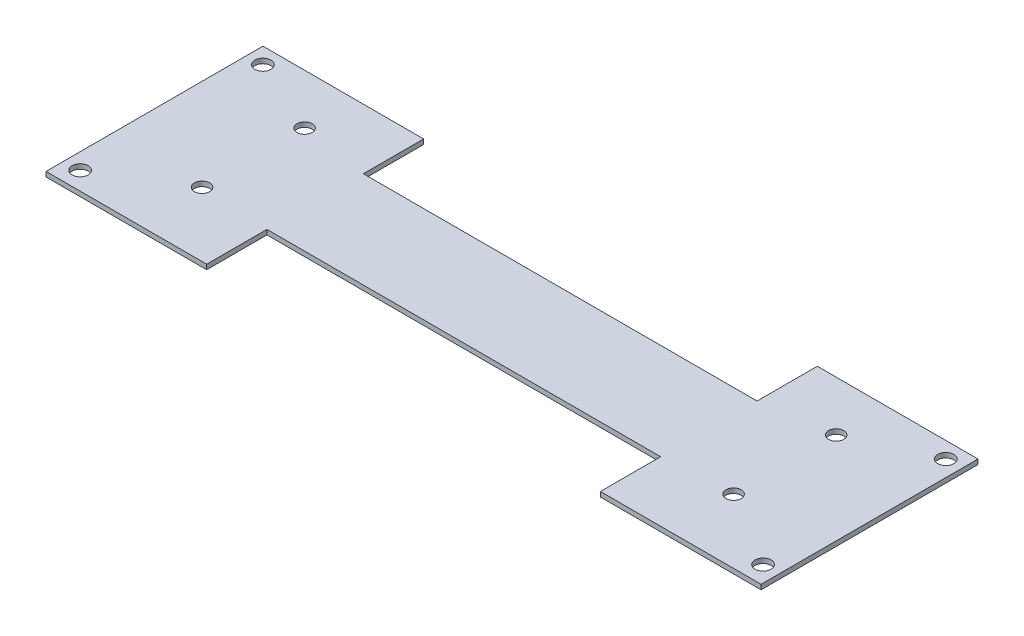
ISO-10303-21;
HEADER;
FILE_DESCRIPTION(('STEP AP214'),'2;1');
FILE_NAME('part.step','',(''),(''),'','','');
FILE_SCHEMA(('AUTOMOTIVE_DESIGN { 1 0 10303 214 1 1 1 1 }'));
ENDSEC;
DATA;
#1=APPLICATION_CONTEXT('core data for automotive mechanical design processes');
#2=APPLICATION_PROTOCOL_DEFINITION('international standard','automotive_design',2000,#1);
#3=PRODUCT_CONTEXT('',#1,'mechanical');
#4=PRODUCT('Part','Part','',(#3));
#5=PRODUCT_RELATED_PRODUCT_CATEGORY('part','',(#4));
#6=PRODUCT_DEFINITION_FORMATION('','',#4);
#7=PRODUCT_DEFINITION_CONTEXT('part definition',#1,'design');
#8=PRODUCT_DEFINITION('design','',#6,#7);
#9=PRODUCT_DEFINITION_SHAPE('','',#8);
#10=(LENGTH_UNIT() NAMED_UNIT(*) SI_UNIT(.MILLI.,.METRE.));
#11=(NAMED_UNIT(*) PLANE_ANGLE_UNIT() SI_UNIT($,.RADIAN.));
#12=(NAMED_UNIT(*) SI_UNIT($,.STERADIAN.) SOLID_ANGLE_UNIT());
#13=UNCERTAINTY_MEASURE_WITH_UNIT(LENGTH_MEASURE(1.E-05),#10,'distance_accuracy_value','');
#14=(GEOMETRIC_REPRESENTATION_CONTEXT(3) GLOBAL_UNCERTAINTY_ASSIGNED_CONTEXT((#13)) GLOBAL_UNIT_ASSIGNED_CONTEXT((#10,
#11,#12)) REPRESENTATION_CONTEXT('',''));
#15=CARTESIAN_POINT('',(0.,0.,0.));
#16=DIRECTION('',(0.,0.,1.));
#17=DIRECTION('',(1.,0.,0.));
#18=AXIS2_PLACEMENT_3D('',#15,#16,#17);
#19=CARTESIAN_POINT('',(-63.9018475988458,-1.2,-32.1837487972709));
#20=DIRECTION('',(0.,0.,-1.));
#21=DIRECTION('',(-1.,0.,0.));
#22=AXIS2_PLACEMENT_3D('',#19,#20,#21);
#23=PLANE('',#22);
#24=DIRECTION('',(0.,1.,0.));
#25=VECTOR('',#24,1.);
#26=CARTESIAN_POINT('',(74.0981524011542,-10.,-32.1837487972709));
#27=LINE('',#26,#25);
#28=CARTESIAN_POINT('',(74.0981524011542,-1.2,-32.1837487972709));
#29=VERTEX_POINT('',#28);
#30=CARTESIAN_POINT('',(74.0981524011542,0.,-32.1837487972709));
#31=VERTEX_POINT('',#30);
#32=EDGE_CURVE('E129',#29,#31,#27,.T.);
#33=ORIENTED_EDGE('',*,*,#32,.T.);
#34=DIRECTION('',(-1.,0.,0.));
#35=VECTOR('',#34,1.);
#36=CARTESIAN_POINT('',(-63.9018475988458,0.,-32.1837487972709));
#37=LINE('',#36,#35);
#38=CARTESIAN_POINT('',(114.098152401154,0.,-32.1837487972709));
#39=VERTEX_POINT('',#38);
#40=EDGE_CURVE('E143',#39,#31,#37,.T.);
#41=ORIENTED_EDGE('',*,*,#40,.F.);
#42=DIRECTION('',(0.,1.,0.));
#43=VECTOR('',#42,1.);
#44=CARTESIAN_POINT('',(114.098152401154,-1.2,-32.1837487972709));
#45=LINE('',#44,#43);
#46=CARTESIAN_POINT('',(114.098152401154,-1.2,-32.1837487972709));
#47=VERTEX_POINT('',#46);
#48=EDGE_CURVE('E43',#47,#39,#45,.T.);
#49=ORIENTED_EDGE('',*,*,#48,.F.);
#50=DIRECTION('',(-1.,0.,0.));
#51=VECTOR('',#50,1.);
#52=CARTESIAN_POINT('',(-63.9018475988458,-1.2,-32.1837487972709));
#53=LINE('',#52,#51);
#54=EDGE_CURVE('E145',#47,#29,#53,.T.);
#55=ORIENTED_EDGE('',*,*,#54,.T.);
#56=EDGE_LOOP('',(#33,#41,#49,#55));
#57=FACE_BOUND('',#56,.T.);
#58=ADVANCED_FACE('F34',(#57),#23,.T.);
#59=CARTESIAN_POINT('',(-63.9018475988458,-1.2,21.8162512027291));
#60=DIRECTION('',(0.,0.,1.));
#61=DIRECTION('',(1.,0.,0.));
#62=AXIS2_PLACEMENT_3D('',#59,#60,#61);
#63=PLANE('',#62);
#64=DIRECTION('',(0.,1.,0.));
#65=VECTOR('',#64,1.);
#66=CARTESIAN_POINT('',(74.0981524011542,-10.,21.8162512027291));
#67=LINE('',#66,#65);
#68=CARTESIAN_POINT('',(74.0981524011542,-1.2,21.8162512027291));
#69=VERTEX_POINT('',#68);
#70=CARTESIAN_POINT('',(74.0981524011542,0.,21.8162512027291));
#71=VERTEX_POINT('',#70);
#72=EDGE_CURVE('E186',#69,#71,#67,.T.);
#73=ORIENTED_EDGE('',*,*,#72,.F.);
#74=DIRECTION('',(1.,0.,0.));
#75=VECTOR('',#74,1.);
#76=CARTESIAN_POINT('',(-63.9018475988458,-1.2,21.8162512027291));
#77=LINE('',#76,#75);
#78=CARTESIAN_POINT('',(114.098152401154,-1.2,21.8162512027291));
#79=VERTEX_POINT('',#78);
#80=EDGE_CURVE('E157',#69,#79,#77,.T.);
#81=ORIENTED_EDGE('',*,*,#80,.T.);
#82=DIRECTION('',(0.,1.,0.));
#83=VECTOR('',#82,1.);
#84=CARTESIAN_POINT('',(114.098152401154,-1.2,21.8162512027291));
#85=LINE('',#84,#83);
#86=CARTESIAN_POINT('',(114.098152401154,0.,21.8162512027291));
#87=VERTEX_POINT('',#86);
#88=EDGE_CURVE('E162',#79,#87,#85,.T.);
#89=ORIENTED_EDGE('',*,*,#88,.T.);
#90=DIRECTION('',(1.,0.,0.));
#91=VECTOR('',#90,1.);
#92=CARTESIAN_POINT('',(-63.9018475988458,0.,21.8162512027291));
#93=LINE('',#92,#91);
#94=EDGE_CURVE('E178',#71,#87,#93,.T.);
#95=ORIENTED_EDGE('',*,*,#94,.F.);
#96=EDGE_LOOP('',(#73,#81,#89,#95));
#97=FACE_BOUND('',#96,.T.);
#98=ADVANCED_FACE('F185',(#97),#63,.T.);
#99=CARTESIAN_POINT('',(-63.9018475988458,-1.2,-32.1837487972709));
#100=DIRECTION('',(-1.,0.,0.));
#101=DIRECTION('',(0.,0.,1.));
#102=AXIS2_PLACEMENT_3D('',#99,#100,#101);
#103=PLANE('',#102);
#104=DIRECTION('',(0.,0.,1.));
#105=VECTOR('',#104,1.);
#106=CARTESIAN_POINT('',(-63.9018475988458,0.,-32.1837487972709));
#107=LINE('',#106,#105);
#108=CARTESIAN_POINT('',(-63.9018475988458,0.,-32.1837487972709));
#109=VERTEX_POINT('',#108);
#110=CARTESIAN_POINT('',(-63.9018475988458,0.,21.8162512027291));
#111=VERTEX_POINT('',#110);
#112=EDGE_CURVE('E176',#109,#111,#107,.T.);
#113=ORIENTED_EDGE('',*,*,#112,.F.);
#114=DIRECTION('',(0.,1.,0.));
#115=VECTOR('',#114,1.);
#116=CARTESIAN_POINT('',(-63.9018475988458,-1.2,-32.1837487972709));
#117=LINE('',#116,#115);
#118=CARTESIAN_POINT('',(-63.9018475988458,-1.2,-32.1837487972709));
#119=VERTEX_POINT('',#118);
#120=EDGE_CURVE('E11',#119,#109,#117,.T.);
#121=ORIENTED_EDGE('',*,*,#120,.F.);
#122=DIRECTION('',(0.,0.,1.));
#123=VECTOR('',#122,1.);
#124=CARTESIAN_POINT('',(-63.9018475988458,-1.2,-32.1837487972709));
#125=LINE('',#124,#123);
#126=CARTESIAN_POINT('',(-63.9018475988458,-1.2,21.8162512027291));
#127=VERTEX_POINT('',#126);
#128=EDGE_CURVE('E153',#119,#127,#125,.T.);
#129=ORIENTED_EDGE('',*,*,#128,.T.);
#130=DIRECTION('',(0.,1.,0.));
#131=VECTOR('',#130,1.);
#132=CARTESIAN_POINT('',(-63.9018475988458,-1.2,21.8162512027291));
#133=LINE('',#132,#131);
#134=EDGE_CURVE('E38',#127,#111,#133,.T.);
#135=ORIENTED_EDGE('',*,*,#134,.T.);
#136=EDGE_LOOP('',(#113,#121,#129,#135));
#137=FACE_BOUND('',#136,.T.);
#138=ADVANCED_FACE('F36',(#137),#103,.T.);
#139=DIRECTION('',(0.,1.,0.));
#140=VECTOR('',#139,1.);
#141=CARTESIAN_POINT('',(-23.9018475988458,-10.,-32.1837487972709));
#142=LINE('',#141,#140);
#143=CARTESIAN_POINT('',(-23.9018475988458,-1.2,-32.1837487972709));
#144=VERTEX_POINT('',#143);
#145=CARTESIAN_POINT('',(-23.9018475988458,0.,-32.1837487972709));
#146=VERTEX_POINT('',#145);
#147=EDGE_CURVE('E51',#144,#146,#142,.T.);
#148=ORIENTED_EDGE('',*,*,#147,.F.);
#149=EDGE_CURVE('E170',#144,#119,#53,.T.);
#150=ORIENTED_EDGE('',*,*,#149,.T.);
#151=ORIENTED_EDGE('',*,*,#120,.T.);
#152=EDGE_CURVE('E154',#146,#109,#37,.T.);
#153=ORIENTED_EDGE('',*,*,#152,.F.);
#154=EDGE_LOOP('',(#148,#150,#151,#153));
#155=FACE_BOUND('',#154,.T.);
#156=ADVANCED_FACE('F314',(#155),#23,.T.);
#157=CARTESIAN_POINT('',(114.098152401154,-1.2,-32.1837487972709));
#158=DIRECTION('',(1.,0.,0.));
#159=DIRECTION('',(0.,0.,-1.));
#160=AXIS2_PLACEMENT_3D('',#157,#158,#159);
#161=PLANE('',#160);
#162=DIRECTION('',(0.,0.,-1.));
#163=VECTOR('',#162,1.);
#164=CARTESIAN_POINT('',(114.098152401154,0.,-32.1837487972709));
#165=LINE('',#164,#163);
#166=EDGE_CURVE('E152',#87,#39,#165,.T.);
#167=ORIENTED_EDGE('',*,*,#166,.F.);
#168=ORIENTED_EDGE('',*,*,#88,.F.);
#169=DIRECTION('',(0.,0.,-1.));
#170=VECTOR('',#169,1.);
#171=CARTESIAN_POINT('',(114.098152401154,-1.2,-32.1837487972709));
#172=LINE('',#171,#170);
#173=EDGE_CURVE('E172',#79,#47,#172,.T.);
#174=ORIENTED_EDGE('',*,*,#173,.T.);
#175=ORIENTED_EDGE('',*,*,#48,.T.);
#176=EDGE_LOOP('',(#167,#168,#174,#175));
#177=FACE_BOUND('',#176,.T.);
#178=ADVANCED_FACE('F308',(#177),#161,.T.);
#179=DIRECTION('',(0.,1.,0.));
#180=VECTOR('',#179,1.);
#181=CARTESIAN_POINT('',(-23.9018475988458,-10.,21.8162512027291));
#182=LINE('',#181,#180);
#183=CARTESIAN_POINT('',(-23.9018475988458,-1.2,21.8162512027291));
#184=VERTEX_POINT('',#183);
#185=CARTESIAN_POINT('',(-23.9018475988458,0.,21.8162512027291));
#186=VERTEX_POINT('',#185);
#187=EDGE_CURVE('E189',#184,#186,#182,.T.);
#188=ORIENTED_EDGE('',*,*,#187,.T.);
#189=EDGE_CURVE('E180',#111,#186,#93,.T.);
#190=ORIENTED_EDGE('',*,*,#189,.F.);
#191=ORIENTED_EDGE('',*,*,#134,.F.);
#192=EDGE_CURVE('E200',#127,#184,#77,.T.);
#193=ORIENTED_EDGE('',*,*,#192,.T.);
#194=EDGE_LOOP('',(#188,#190,#191,#193));
#195=FACE_BOUND('',#194,.T.);
#196=ADVANCED_FACE('F302',(#195),#63,.T.);
#197=CARTESIAN_POINT('',(0.,-1.2,0.));
#198=DIRECTION('',(0.,1.,0.));
#199=DIRECTION('',(0.,0.,1.));
#200=AXIS2_PLACEMENT_3D('',#197,#198,#199);
#201=PLANE('',#200);
#202=CARTESIAN_POINT('',(-59.9018475988458,-1.2,-28.1837487972709));
#203=DIRECTION('',(0.,1.,0.));
#204=DIRECTION('',(0.,0.,1.));
#205=AXIS2_PLACEMENT_3D('',#202,#203,#204);
#206=CIRCLE('',#205,2.);
#207=CARTESIAN_POINT('',(-59.9018475988458,-1.2,-26.1837487972709));
#208=VERTEX_POINT('',#207);
#209=EDGE_CURVE('E273',#208,#208,#206,.T.);
#210=ORIENTED_EDGE('',*,*,#209,.T.);
#211=EDGE_LOOP('',(#210));
#212=FACE_BOUND('',#211,.T.);
#213=CARTESIAN_POINT('',(-59.9018475988458,-1.2,17.3162512027291));
#214=DIRECTION('',(0.,1.,0.));
#215=DIRECTION('',(0.,0.,1.));
#216=AXIS2_PLACEMENT_3D('',#213,#214,#215);
#217=CIRCLE('',#216,2.);
#218=CARTESIAN_POINT('',(-59.9018475988458,-1.2,19.3162512027291));
#219=VERTEX_POINT('',#218);
#220=EDGE_CURVE('E267',#219,#219,#217,.T.);
#221=ORIENTED_EDGE('',*,*,#220,.T.);
#222=EDGE_LOOP('',(#221));
#223=FACE_BOUND('',#222,.T.);
#224=CARTESIAN_POINT('',(110.098152401154,-1.2,-28.1837487972709));
#225=DIRECTION('',(0.,1.,0.));
#226=DIRECTION('',(0.,0.,1.));
#227=AXIS2_PLACEMENT_3D('',#224,#225,#226);
#228=CIRCLE('',#227,2.);
#229=CARTESIAN_POINT('',(110.098152401154,-1.2,-26.1837487972709));
#230=VERTEX_POINT('',#229);
#231=EDGE_CURVE('E261',#230,#230,#228,.T.);
#232=ORIENTED_EDGE('',*,*,#231,.T.);
#233=EDGE_LOOP('',(#232));
#234=FACE_BOUND('',#233,.T.);
#235=CARTESIAN_POINT('',(110.098152401154,-1.2,17.3162512027291));
#236=DIRECTION('',(0.,1.,0.));
#237=DIRECTION('',(0.,0.,1.));
#238=AXIS2_PLACEMENT_3D('',#235,#236,#237);
#239=CIRCLE('',#238,2.);
#240=CARTESIAN_POINT('',(110.098152401154,-1.2,19.3162512027291));
#241=VERTEX_POINT('',#240);
#242=EDGE_CURVE('E138',#241,#241,#239,.T.);
#243=ORIENTED_EDGE('',*,*,#242,.T.);
#244=EDGE_LOOP('',(#243));
#245=FACE_BOUND('',#244,.T.);
#246=DIRECTION('',(1.,0.,0.));
#247=VECTOR('',#246,1.);
#248=CARTESIAN_POINT('',(0.,-1.2,-17.1837487972709));
#249=LINE('',#248,#247);
#250=CARTESIAN_POINT('',(-23.9018475988458,-1.2,-17.1837487972709));
#251=VERTEX_POINT('',#250);
#252=CARTESIAN_POINT('',(74.0981524011542,-1.2,-17.1837487972709));
#253=VERTEX_POINT('',#252);
#254=EDGE_CURVE('E245',#251,#253,#249,.T.);
#255=ORIENTED_EDGE('',*,*,#254,.T.);
#256=DIRECTION('',(0.,0.,-1.));
#257=VECTOR('',#256,1.);
#258=CARTESIAN_POINT('',(74.0981524011542,-1.2,0.));
#259=LINE('',#258,#257);
#260=EDGE_CURVE('E243',#253,#29,#259,.T.);
#261=ORIENTED_EDGE('',*,*,#260,.T.);
#262=ORIENTED_EDGE('',*,*,#54,.F.);
#263=ORIENTED_EDGE('',*,*,#173,.F.);
#264=ORIENTED_EDGE('',*,*,#80,.F.);
#265=DIRECTION('',(0.,0.,-1.));
#266=VECTOR('',#265,1.);
#267=CARTESIAN_POINT('',(74.0981524011542,-1.2,0.));
#268=LINE('',#267,#266);
#269=CARTESIAN_POINT('',(74.0981524011542,-1.2,6.81625120272913));
#270=VERTEX_POINT('',#269);
#271=EDGE_CURVE('E198',#69,#270,#268,.T.);
#272=ORIENTED_EDGE('',*,*,#271,.T.);
#273=DIRECTION('',(-1.,0.,0.));
#274=VECTOR('',#273,1.);
#275=CARTESIAN_POINT('',(0.,-1.2,6.81625120272913));
#276=LINE('',#275,#274);
#277=CARTESIAN_POINT('',(-23.9018475988458,-1.2,6.81625120272913));
#278=VERTEX_POINT('',#277);
#279=EDGE_CURVE('E188',#270,#278,#276,.T.);
#280=ORIENTED_EDGE('',*,*,#279,.T.);
#281=DIRECTION('',(0.,0.,1.));
#282=VECTOR('',#281,1.);
#283=CARTESIAN_POINT('',(-23.9018475988458,-1.2,0.));
#284=LINE('',#283,#282);
#285=EDGE_CURVE('E227',#278,#184,#284,.T.);
#286=ORIENTED_EDGE('',*,*,#285,.T.);
#287=ORIENTED_EDGE('',*,*,#192,.F.);
#288=ORIENTED_EDGE('',*,*,#128,.F.);
#289=ORIENTED_EDGE('',*,*,#149,.F.);
#290=DIRECTION('',(0.,0.,1.));
#291=VECTOR('',#290,1.);
#292=CARTESIAN_POINT('',(-23.9018475988458,-1.2,0.));
#293=LINE('',#292,#291);
#294=EDGE_CURVE('E247',#144,#251,#293,.T.);
#295=ORIENTED_EDGE('',*,*,#294,.T.);
#296=EDGE_LOOP('',(#255,#261,#262,#263,#264,#272,#280,#286,#287,#288,#289,#295));
#297=FACE_BOUND('',#296,.T.);
#298=CARTESIAN_POINT('',(-41.0568475988458,-1.2,-19.7137487972709));
#299=DIRECTION('',(0.,1.,0.));
#300=DIRECTION('',(0.,0.,1.));
#301=AXIS2_PLACEMENT_3D('',#298,#299,#300);
#302=CIRCLE('',#301,1.9);
#303=CARTESIAN_POINT('',(-41.0568475988458,-1.2,-17.8137487972709));
#304=VERTEX_POINT('',#303);
#305=EDGE_CURVE('E220',#304,#304,#302,.T.);
#306=ORIENTED_EDGE('',*,*,#305,.T.);
#307=EDGE_LOOP('',(#306));
#308=FACE_BOUND('',#307,.T.);
#309=CARTESIAN_POINT('',(91.2531524011542,-1.2,-19.7137487972709));
#310=DIRECTION('',(0.,1.,0.));
#311=DIRECTION('',(0.,0.,1.));
#312=AXIS2_PLACEMENT_3D('',#309,#310,#311);
#313=CIRCLE('',#312,1.9);
#314=CARTESIAN_POINT('',(91.2531524011542,-1.2,-17.8137487972709));
#315=VERTEX_POINT('',#314);
#316=EDGE_CURVE('E214',#315,#315,#313,.T.);
#317=ORIENTED_EDGE('',*,*,#316,.T.);
#318=EDGE_LOOP('',(#317));
#319=FACE_BOUND('',#318,.T.);
#320=CARTESIAN_POINT('',(-41.0568475988458,-1.2,5.81625120272912));
#321=DIRECTION('',(0.,1.,0.));
#322=DIRECTION('',(0.,0.,1.));
#323=AXIS2_PLACEMENT_3D('',#320,#321,#322);
#324=CIRCLE('',#323,1.9);
#325=CARTESIAN_POINT('',(-41.0568475988458,-1.2,7.71625120272912));
#326=VERTEX_POINT('',#325);
#327=EDGE_CURVE('E208',#326,#326,#324,.T.);
#328=ORIENTED_EDGE('',*,*,#327,.T.);
#329=EDGE_LOOP('',(#328));
#330=FACE_BOUND('',#329,.T.);
#331=CARTESIAN_POINT('',(91.2531524011542,-1.2,5.81625120272912));
#332=DIRECTION('',(0.,1.,0.));
#333=DIRECTION('',(0.,0.,1.));
#334=AXIS2_PLACEMENT_3D('',#331,#332,#333);
#335=CIRCLE('',#334,1.9);
#336=CARTESIAN_POINT('',(91.2531524011542,-1.2,7.71625120272912));
#337=VERTEX_POINT('',#336);
#338=EDGE_CURVE('E179',#337,#337,#335,.T.);
#339=ORIENTED_EDGE('',*,*,#338,.T.);
#340=EDGE_LOOP('',(#339));
#341=FACE_BOUND('',#340,.T.);
#342=ADVANCED_FACE('F195',(#212,#223,#234,#245,#297,#308,#319,#330,#341),#201,.F.);
#343=CARTESIAN_POINT('',(0.,0.,0.));
#344=DIRECTION('',(0.,1.,0.));
#345=DIRECTION('',(0.,0.,1.));
#346=AXIS2_PLACEMENT_3D('',#343,#344,#345);
#347=PLANE('',#346);
#348=CARTESIAN_POINT('',(-59.9018475988458,0.,-28.1837487972709));
#349=DIRECTION('',(0.,1.,0.));
#350=DIRECTION('',(0.,0.,1.));
#351=AXIS2_PLACEMENT_3D('',#348,#349,#350);
#352=CIRCLE('',#351,2.);
#353=CARTESIAN_POINT('',(-59.9018475988458,0.,-26.1837487972709));
#354=VERTEX_POINT('',#353);
#355=EDGE_CURVE('E276',#354,#354,#352,.T.);
#356=ORIENTED_EDGE('',*,*,#355,.F.);
#357=EDGE_LOOP('',(#356));
#358=FACE_BOUND('',#357,.T.);
#359=CARTESIAN_POINT('',(-59.9018475988458,0.,17.3162512027291));
#360=DIRECTION('',(0.,1.,0.));
#361=DIRECTION('',(0.,0.,1.));
#362=AXIS2_PLACEMENT_3D('',#359,#360,#361);
#363=CIRCLE('',#362,2.);
#364=CARTESIAN_POINT('',(-59.9018475988458,0.,19.3162512027291));
#365=VERTEX_POINT('',#364);
#366=EDGE_CURVE('E270',#365,#365,#363,.T.);
#367=ORIENTED_EDGE('',*,*,#366,.F.);
#368=EDGE_LOOP('',(#367));
#369=FACE_BOUND('',#368,.T.);
#370=CARTESIAN_POINT('',(110.098152401154,0.,-28.1837487972709));
#371=DIRECTION('',(0.,1.,0.));
#372=DIRECTION('',(0.,0.,1.));
#373=AXIS2_PLACEMENT_3D('',#370,#371,#372);
#374=CIRCLE('',#373,2.);
#375=CARTESIAN_POINT('',(110.098152401154,0.,-26.1837487972709));
#376=VERTEX_POINT('',#375);
#377=EDGE_CURVE('E264',#376,#376,#374,.T.);
#378=ORIENTED_EDGE('',*,*,#377,.F.);
#379=EDGE_LOOP('',(#378));
#380=FACE_BOUND('',#379,.T.);
#381=CARTESIAN_POINT('',(110.098152401154,0.,17.3162512027291));
#382=DIRECTION('',(0.,1.,0.));
#383=DIRECTION('',(0.,0.,1.));
#384=AXIS2_PLACEMENT_3D('',#381,#382,#383);
#385=CIRCLE('',#384,2.);
#386=CARTESIAN_POINT('',(110.098152401154,0.,19.3162512027291));
#387=VERTEX_POINT('',#386);
#388=EDGE_CURVE('E258',#387,#387,#385,.T.);
#389=ORIENTED_EDGE('',*,*,#388,.F.);
#390=EDGE_LOOP('',(#389));
#391=FACE_BOUND('',#390,.T.);
#392=DIRECTION('',(0.,0.,-1.));
#393=VECTOR('',#392,1.);
#394=CARTESIAN_POINT('',(74.0981524011542,0.,-32.1837487972709));
#395=LINE('',#394,#393);
#396=CARTESIAN_POINT('',(74.0981524011542,0.,-17.1837487972709));
#397=VERTEX_POINT('',#396);
#398=EDGE_CURVE('E126',#397,#31,#395,.T.);
#399=ORIENTED_EDGE('',*,*,#398,.F.);
#400=DIRECTION('',(1.,0.,0.));
#401=VECTOR('',#400,1.);
#402=CARTESIAN_POINT('',(74.0981524011542,0.,-17.1837487972709));
#403=LINE('',#402,#401);
#404=CARTESIAN_POINT('',(-23.9018475988458,0.,-17.1837487972709));
#405=VERTEX_POINT('',#404);
#406=EDGE_CURVE('E146',#405,#397,#403,.T.);
#407=ORIENTED_EDGE('',*,*,#406,.F.);
#408=DIRECTION('',(0.,0.,1.));
#409=VECTOR('',#408,1.);
#410=CARTESIAN_POINT('',(-23.9018475988458,0.,-32.1837487972709));
#411=LINE('',#410,#409);
#412=EDGE_CURVE('E137',#146,#405,#411,.T.);
#413=ORIENTED_EDGE('',*,*,#412,.F.);
#414=ORIENTED_EDGE('',*,*,#152,.T.);
#415=ORIENTED_EDGE('',*,*,#112,.T.);
#416=ORIENTED_EDGE('',*,*,#189,.T.);
#417=DIRECTION('',(0.,0.,1.));
#418=VECTOR('',#417,1.);
#419=CARTESIAN_POINT('',(-23.9018475988458,0.,21.8162512027291));
#420=LINE('',#419,#418);
#421=CARTESIAN_POINT('',(-23.9018475988458,0.,6.81625120272913));
#422=VERTEX_POINT('',#421);
#423=EDGE_CURVE('E234',#422,#186,#420,.T.);
#424=ORIENTED_EDGE('',*,*,#423,.F.);
#425=DIRECTION('',(-1.,0.,0.));
#426=VECTOR('',#425,1.);
#427=CARTESIAN_POINT('',(74.0981524011542,0.,6.81625120272913));
#428=LINE('',#427,#426);
#429=CARTESIAN_POINT('',(74.0981524011542,0.,6.81625120272913));
#430=VERTEX_POINT('',#429);
#431=EDGE_CURVE('E239',#430,#422,#428,.T.);
#432=ORIENTED_EDGE('',*,*,#431,.F.);
#433=DIRECTION('',(0.,0.,-1.));
#434=VECTOR('',#433,1.);
#435=CARTESIAN_POINT('',(74.0981524011542,0.,21.8162512027291));
#436=LINE('',#435,#434);
#437=EDGE_CURVE('E59',#71,#430,#436,.T.);
#438=ORIENTED_EDGE('',*,*,#437,.F.);
#439=ORIENTED_EDGE('',*,*,#94,.T.);
#440=ORIENTED_EDGE('',*,*,#166,.T.);
#441=ORIENTED_EDGE('',*,*,#40,.T.);
#442=EDGE_LOOP('',(#399,#407,#413,#414,#415,#416,#424,#432,#438,#439,#440,#441));
#443=FACE_BOUND('',#442,.T.);
#444=CARTESIAN_POINT('',(-41.0568475988458,0.,-19.7137487972709));
#445=DIRECTION('',(0.,1.,0.));
#446=DIRECTION('',(0.,0.,1.));
#447=AXIS2_PLACEMENT_3D('',#444,#445,#446);
#448=CIRCLE('',#447,1.9);
#449=CARTESIAN_POINT('',(-41.0568475988458,0.,-17.8137487972709));
#450=VERTEX_POINT('',#449);
#451=EDGE_CURVE('E223',#450,#450,#448,.T.);
#452=ORIENTED_EDGE('',*,*,#451,.F.);
#453=EDGE_LOOP('',(#452));
#454=FACE_BOUND('',#453,.T.);
#455=CARTESIAN_POINT('',(91.2531524011542,0.,-19.7137487972709));
#456=DIRECTION('',(0.,1.,0.));
#457=DIRECTION('',(0.,0.,1.));
#458=AXIS2_PLACEMENT_3D('',#455,#456,#457);
#459=CIRCLE('',#458,1.9);
#460=CARTESIAN_POINT('',(91.2531524011542,0.,-17.8137487972709));
#461=VERTEX_POINT('',#460);
#462=EDGE_CURVE('E217',#461,#461,#459,.T.);
#463=ORIENTED_EDGE('',*,*,#462,.F.);
#464=EDGE_LOOP('',(#463));
#465=FACE_BOUND('',#464,.T.);
#466=CARTESIAN_POINT('',(-41.0568475988458,0.,5.81625120272912));
#467=DIRECTION('',(0.,1.,0.));
#468=DIRECTION('',(0.,0.,1.));
#469=AXIS2_PLACEMENT_3D('',#466,#467,#468);
#470=CIRCLE('',#469,1.9);
#471=CARTESIAN_POINT('',(-41.0568475988458,0.,7.71625120272912));
#472=VERTEX_POINT('',#471);
#473=EDGE_CURVE('E211',#472,#472,#470,.T.);
#474=ORIENTED_EDGE('',*,*,#473,.F.);
#475=EDGE_LOOP('',(#474));
#476=FACE_BOUND('',#475,.T.);
#477=CARTESIAN_POINT('',(91.2531524011542,0.,5.81625120272912));
#478=DIRECTION('',(0.,1.,0.));
#479=DIRECTION('',(0.,0.,1.));
#480=AXIS2_PLACEMENT_3D('',#477,#478,#479);
#481=CIRCLE('',#480,1.9);
#482=CARTESIAN_POINT('',(91.2531524011542,0.,7.71625120272912));
#483=VERTEX_POINT('',#482);
#484=EDGE_CURVE('E205',#483,#483,#481,.T.);
#485=ORIENTED_EDGE('',*,*,#484,.F.);
#486=EDGE_LOOP('',(#485));
#487=FACE_BOUND('',#486,.T.);
#488=ADVANCED_FACE('F149',(#358,#369,#380,#391,#443,#454,#465,#476,#487),#347,.T.);
#489=CARTESIAN_POINT('',(91.2531524011542,-10.,5.81625120272912));
#490=DIRECTION('',(0.,1.,0.));
#491=DIRECTION('',(0.,0.,1.));
#492=AXIS2_PLACEMENT_3D('',#489,#490,#491);
#493=CYLINDRICAL_SURFACE('',#492,1.9);
#494=ORIENTED_EDGE('',*,*,#484,.T.);
#495=EDGE_LOOP('',(#494));
#496=FACE_BOUND('',#495,.T.);
#497=ORIENTED_EDGE('',*,*,#338,.F.);
#498=EDGE_LOOP('',(#497));
#499=FACE_BOUND('',#498,.T.);
#500=ADVANCED_FACE('F285',(#496,#499),#493,.F.);
#501=CARTESIAN_POINT('',(-41.0568475988458,-10.,5.81625120272912));
#502=DIRECTION('',(0.,1.,0.));
#503=DIRECTION('',(0.,0.,1.));
#504=AXIS2_PLACEMENT_3D('',#501,#502,#503);
#505=CYLINDRICAL_SURFACE('',#504,1.9);
#506=ORIENTED_EDGE('',*,*,#473,.T.);
#507=EDGE_LOOP('',(#506));
#508=FACE_BOUND('',#507,.T.);
#509=ORIENTED_EDGE('',*,*,#327,.F.);
#510=EDGE_LOOP('',(#509));
#511=FACE_BOUND('',#510,.T.);
#512=ADVANCED_FACE('F362',(#508,#511),#505,.F.);
#513=CARTESIAN_POINT('',(91.2531524011542,-10.,-19.7137487972709));
#514=DIRECTION('',(0.,1.,0.));
#515=DIRECTION('',(0.,0.,1.));
#516=AXIS2_PLACEMENT_3D('',#513,#514,#515);
#517=CYLINDRICAL_SURFACE('',#516,1.9);
#518=ORIENTED_EDGE('',*,*,#462,.T.);
#519=EDGE_LOOP('',(#518));
#520=FACE_BOUND('',#519,.T.);
#521=ORIENTED_EDGE('',*,*,#316,.F.);
#522=EDGE_LOOP('',(#521));
#523=FACE_BOUND('',#522,.T.);
#524=ADVANCED_FACE('F358',(#520,#523),#517,.F.);
#525=CARTESIAN_POINT('',(-41.0568475988458,-10.,-19.7137487972709));
#526=DIRECTION('',(0.,1.,0.));
#527=DIRECTION('',(0.,0.,1.));
#528=AXIS2_PLACEMENT_3D('',#525,#526,#527);
#529=CYLINDRICAL_SURFACE('',#528,1.9);
#530=ORIENTED_EDGE('',*,*,#451,.T.);
#531=EDGE_LOOP('',(#530));
#532=FACE_BOUND('',#531,.T.);
#533=ORIENTED_EDGE('',*,*,#305,.F.);
#534=EDGE_LOOP('',(#533));
#535=FACE_BOUND('',#534,.T.);
#536=ADVANCED_FACE('F355',(#532,#535),#529,.F.);
#537=CARTESIAN_POINT('',(74.0981524011542,-10.,21.8162512027291));
#538=DIRECTION('',(1.,0.,0.));
#539=DIRECTION('',(0.,0.,-1.));
#540=AXIS2_PLACEMENT_3D('',#537,#538,#539);
#541=PLANE('',#540);
#542=ORIENTED_EDGE('',*,*,#72,.T.);
#543=ORIENTED_EDGE('',*,*,#437,.T.);
#544=DIRECTION('',(0.,1.,0.));
#545=VECTOR('',#544,1.);
#546=CARTESIAN_POINT('',(74.0981524011542,-10.,6.81625120272913));
#547=LINE('',#546,#545);
#548=EDGE_CURVE('E231',#270,#430,#547,.T.);
#549=ORIENTED_EDGE('',*,*,#548,.F.);
#550=ORIENTED_EDGE('',*,*,#271,.F.);
#551=EDGE_LOOP('',(#542,#543,#549,#550));
#552=FACE_BOUND('',#551,.T.);
#553=ADVANCED_FACE('F348',(#552),#541,.F.);
#554=CARTESIAN_POINT('',(-23.9018475988458,-10.,21.8162512027291));
#555=DIRECTION('',(-1.,0.,0.));
#556=DIRECTION('',(0.,0.,1.));
#557=AXIS2_PLACEMENT_3D('',#554,#555,#556);
#558=PLANE('',#557);
#559=DIRECTION('',(0.,1.,0.));
#560=VECTOR('',#559,1.);
#561=CARTESIAN_POINT('',(-23.9018475988458,-10.,6.81625120272913));
#562=LINE('',#561,#560);
#563=EDGE_CURVE('E233',#278,#422,#562,.T.);
#564=ORIENTED_EDGE('',*,*,#563,.T.);
#565=ORIENTED_EDGE('',*,*,#423,.T.);
#566=ORIENTED_EDGE('',*,*,#187,.F.);
#567=ORIENTED_EDGE('',*,*,#285,.F.);
#568=EDGE_LOOP('',(#564,#565,#566,#567));
#569=FACE_BOUND('',#568,.T.);
#570=ADVANCED_FACE('F345',(#569),#558,.F.);
#571=CARTESIAN_POINT('',(74.0981524011542,-10.,6.81625120272913));
#572=DIRECTION('',(0.,0.,-1.));
#573=DIRECTION('',(-1.,0.,0.));
#574=AXIS2_PLACEMENT_3D('',#571,#572,#573);
#575=PLANE('',#574);
#576=ORIENTED_EDGE('',*,*,#548,.T.);
#577=ORIENTED_EDGE('',*,*,#431,.T.);
#578=ORIENTED_EDGE('',*,*,#563,.F.);
#579=ORIENTED_EDGE('',*,*,#279,.F.);
#580=EDGE_LOOP('',(#576,#577,#578,#579));
#581=FACE_BOUND('',#580,.T.);
#582=ADVANCED_FACE('F341',(#581),#575,.F.);
#583=CARTESIAN_POINT('',(74.0981524011542,-10.,-32.1837487972709));
#584=DIRECTION('',(1.,0.,0.));
#585=DIRECTION('',(0.,0.,-1.));
#586=AXIS2_PLACEMENT_3D('',#583,#584,#585);
#587=PLANE('',#586);
#588=DIRECTION('',(0.,1.,0.));
#589=VECTOR('',#588,1.);
#590=CARTESIAN_POINT('',(74.0981524011542,-10.,-17.1837487972709));
#591=LINE('',#590,#589);
#592=EDGE_CURVE('E132',#253,#397,#591,.T.);
#593=ORIENTED_EDGE('',*,*,#592,.T.);
#594=ORIENTED_EDGE('',*,*,#398,.T.);
#595=ORIENTED_EDGE('',*,*,#32,.F.);
#596=ORIENTED_EDGE('',*,*,#260,.F.);
#597=EDGE_LOOP('',(#593,#594,#595,#596));
#598=FACE_BOUND('',#597,.T.);
#599=ADVANCED_FACE('F128',(#598),#587,.F.);
#600=CARTESIAN_POINT('',(74.0981524011542,-10.,-17.1837487972709));
#601=DIRECTION('',(0.,0.,1.));
#602=DIRECTION('',(1.,0.,0.));
#603=AXIS2_PLACEMENT_3D('',#600,#601,#602);
#604=PLANE('',#603);
#605=DIRECTION('',(0.,1.,0.));
#606=VECTOR('',#605,1.);
#607=CARTESIAN_POINT('',(-23.9018475988458,-10.,-17.1837487972709));
#608=LINE('',#607,#606);
#609=EDGE_CURVE('E251',#251,#405,#608,.T.);
#610=ORIENTED_EDGE('',*,*,#609,.T.);
#611=ORIENTED_EDGE('',*,*,#406,.T.);
#612=ORIENTED_EDGE('',*,*,#592,.F.);
#613=ORIENTED_EDGE('',*,*,#254,.F.);
#614=EDGE_LOOP('',(#610,#611,#612,#613));
#615=FACE_BOUND('',#614,.T.);
#616=ADVANCED_FACE('F333',(#615),#604,.F.);
#617=CARTESIAN_POINT('',(-23.9018475988458,-10.,-32.1837487972709));
#618=DIRECTION('',(-1.,0.,0.));
#619=DIRECTION('',(0.,0.,1.));
#620=AXIS2_PLACEMENT_3D('',#617,#618,#619);
#621=PLANE('',#620);
#622=ORIENTED_EDGE('',*,*,#147,.T.);
#623=ORIENTED_EDGE('',*,*,#412,.T.);
#624=ORIENTED_EDGE('',*,*,#609,.F.);
#625=ORIENTED_EDGE('',*,*,#294,.F.);
#626=EDGE_LOOP('',(#622,#623,#624,#625));
#627=FACE_BOUND('',#626,.T.);
#628=ADVANCED_FACE('F297',(#627),#621,.F.);
#629=CARTESIAN_POINT('',(110.098152401154,-10.,17.3162512027291));
#630=DIRECTION('',(0.,1.,0.));
#631=DIRECTION('',(0.,0.,1.));
#632=AXIS2_PLACEMENT_3D('',#629,#630,#631);
#633=CYLINDRICAL_SURFACE('',#632,2.);
#634=ORIENTED_EDGE('',*,*,#388,.T.);
#635=EDGE_LOOP('',(#634));
#636=FACE_BOUND('',#635,.T.);
#637=ORIENTED_EDGE('',*,*,#242,.F.);
#638=EDGE_LOOP('',(#637));
#639=FACE_BOUND('',#638,.T.);
#640=ADVANCED_FACE('F293',(#636,#639),#633,.F.);
#641=CARTESIAN_POINT('',(110.098152401154,-10.,-28.1837487972709));
#642=DIRECTION('',(0.,1.,0.));
#643=DIRECTION('',(0.,0.,1.));
#644=AXIS2_PLACEMENT_3D('',#641,#642,#643);
#645=CYLINDRICAL_SURFACE('',#644,2.);
#646=ORIENTED_EDGE('',*,*,#377,.T.);
#647=EDGE_LOOP('',(#646));
#648=FACE_BOUND('',#647,.T.);
#649=ORIENTED_EDGE('',*,*,#231,.F.);
#650=EDGE_LOOP('',(#649));
#651=FACE_BOUND('',#650,.T.);
#652=ADVANCED_FACE('F296',(#648,#651),#645,.F.);
#653=CARTESIAN_POINT('',(-59.9018475988458,-10.,17.3162512027291));
#654=DIRECTION('',(0.,1.,0.));
#655=DIRECTION('',(0.,0.,1.));
#656=AXIS2_PLACEMENT_3D('',#653,#654,#655);
#657=CYLINDRICAL_SURFACE('',#656,2.);
#658=ORIENTED_EDGE('',*,*,#366,.T.);
#659=EDGE_LOOP('',(#658));
#660=FACE_BOUND('',#659,.T.);
#661=ORIENTED_EDGE('',*,*,#220,.F.);
#662=EDGE_LOOP('',(#661));
#663=FACE_BOUND('',#662,.T.);
#664=ADVANCED_FACE('F435',(#660,#663),#657,.F.);
#665=CARTESIAN_POINT('',(-59.9018475988458,-10.,-28.1837487972709));
#666=DIRECTION('',(0.,1.,0.));
#667=DIRECTION('',(0.,0.,1.));
#668=AXIS2_PLACEMENT_3D('',#665,#666,#667);
#669=CYLINDRICAL_SURFACE('',#668,2.);
#670=ORIENTED_EDGE('',*,*,#355,.T.);
#671=EDGE_LOOP('',(#670));
#672=FACE_BOUND('',#671,.T.);
#673=ORIENTED_EDGE('',*,*,#209,.F.);
#674=EDGE_LOOP('',(#673));
#675=FACE_BOUND('',#674,.T.);
#676=ADVANCED_FACE('F280',(#672,#675),#669,.F.);
#677=CLOSED_SHELL('',(#58,#98,#138,#156,#178,#196,#342,#488,#500,#512,#524,#536,#553,#570,#582,
#599,#616,#628,#640,#652,#664,#676));
#678=MANIFOLD_SOLID_BREP('B2',#677);
#679=ADVANCED_BREP_SHAPE_REPRESENTATION('',(#18,#678),#14);
#680=SHAPE_DEFINITION_REPRESENTATION(#9,#679);
ENDSEC;
END-ISO-10303-21;
